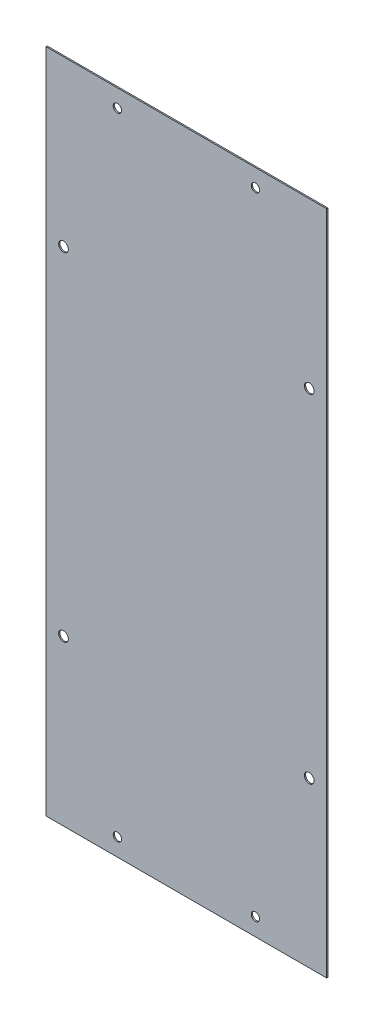
ISO-10303-21;
HEADER;
FILE_DESCRIPTION(('STEP AP214'),'2;1');
FILE_NAME('part.step','',(''),(''),'','','');
FILE_SCHEMA(('AUTOMOTIVE_DESIGN { 1 0 10303 214 1 1 1 1 }'));
ENDSEC;
DATA;
#1=APPLICATION_CONTEXT('core data for automotive mechanical design processes');
#2=APPLICATION_PROTOCOL_DEFINITION('international standard','automotive_design',2000,#1);
#3=PRODUCT_CONTEXT('',#1,'mechanical');
#4=PRODUCT('Part','Part','',(#3));
#5=PRODUCT_RELATED_PRODUCT_CATEGORY('part','',(#4));
#6=PRODUCT_DEFINITION_FORMATION('','',#4);
#7=PRODUCT_DEFINITION_CONTEXT('part definition',#1,'design');
#8=PRODUCT_DEFINITION('design','',#6,#7);
#9=PRODUCT_DEFINITION_SHAPE('','',#8);
#10=(LENGTH_UNIT() NAMED_UNIT(*) SI_UNIT(.MILLI.,.METRE.));
#11=(NAMED_UNIT(*) PLANE_ANGLE_UNIT() SI_UNIT($,.RADIAN.));
#12=(NAMED_UNIT(*) SI_UNIT($,.STERADIAN.) SOLID_ANGLE_UNIT());
#13=UNCERTAINTY_MEASURE_WITH_UNIT(LENGTH_MEASURE(1.E-05),#10,'distance_accuracy_value','');
#14=(GEOMETRIC_REPRESENTATION_CONTEXT(3) GLOBAL_UNCERTAINTY_ASSIGNED_CONTEXT((#13)) GLOBAL_UNIT_ASSIGNED_CONTEXT((#10,
#11,#12)) REPRESENTATION_CONTEXT('',''));
#15=CARTESIAN_POINT('',(0.,0.,0.));
#16=DIRECTION('',(0.,0.,1.));
#17=DIRECTION('',(1.,0.,0.));
#18=AXIS2_PLACEMENT_3D('',#15,#16,#17);
#19=CARTESIAN_POINT('',(101.6,241.3,0.9));
#20=DIRECTION('',(-1.,0.,0.));
#21=DIRECTION('',(0.,-1.,0.));
#22=AXIS2_PLACEMENT_3D('',#19,#20,#21);
#23=PLANE('',#22);
#24=DIRECTION('',(0.,1.,0.));
#25=VECTOR('',#24,1.);
#26=CARTESIAN_POINT('',(101.6,241.3,0.));
#27=LINE('',#26,#25);
#28=CARTESIAN_POINT('',(101.6,-241.3,0.));
#29=VERTEX_POINT('',#28);
#30=CARTESIAN_POINT('',(101.6,241.3,0.));
#31=VERTEX_POINT('',#30);
#32=EDGE_CURVE('E114',#29,#31,#27,.T.);
#33=ORIENTED_EDGE('',*,*,#32,.T.);
#34=DIRECTION('',(0.,0.,-1.));
#35=VECTOR('',#34,1.);
#36=CARTESIAN_POINT('',(101.6,241.3,0.9));
#37=LINE('',#36,#35);
#38=CARTESIAN_POINT('',(101.6,241.3,0.9));
#39=VERTEX_POINT('',#38);
#40=EDGE_CURVE('E11',#39,#31,#37,.T.);
#41=ORIENTED_EDGE('',*,*,#40,.F.);
#42=DIRECTION('',(0.,1.,0.));
#43=VECTOR('',#42,1.);
#44=CARTESIAN_POINT('',(101.6,241.3,0.9));
#45=LINE('',#44,#43);
#46=CARTESIAN_POINT('',(101.6,-241.3,0.9));
#47=VERTEX_POINT('',#46);
#48=EDGE_CURVE('E96',#47,#39,#45,.T.);
#49=ORIENTED_EDGE('',*,*,#48,.F.);
#50=DIRECTION('',(0.,0.,-1.));
#51=VECTOR('',#50,1.);
#52=CARTESIAN_POINT('',(101.6,-241.3,0.9));
#53=LINE('',#52,#51);
#54=EDGE_CURVE('E110',#47,#29,#53,.T.);
#55=ORIENTED_EDGE('',*,*,#54,.T.);
#56=EDGE_LOOP('',(#33,#41,#49,#55));
#57=FACE_BOUND('',#56,.T.);
#58=ADVANCED_FACE('F42',(#57),#23,.F.);
#59=CARTESIAN_POINT('',(-101.6,241.3,0.9));
#60=DIRECTION('',(0.,-1.,0.));
#61=DIRECTION('',(0.,0.,-1.));
#62=AXIS2_PLACEMENT_3D('',#59,#60,#61);
#63=PLANE('',#62);
#64=DIRECTION('',(-1.,0.,0.));
#65=VECTOR('',#64,1.);
#66=CARTESIAN_POINT('',(-101.6,241.3,0.));
#67=LINE('',#66,#65);
#68=CARTESIAN_POINT('',(-101.6,241.3,0.));
#69=VERTEX_POINT('',#68);
#70=EDGE_CURVE('E101',#31,#69,#67,.T.);
#71=ORIENTED_EDGE('',*,*,#70,.T.);
#72=DIRECTION('',(0.,0.,-1.));
#73=VECTOR('',#72,1.);
#74=CARTESIAN_POINT('',(-101.6,241.3,0.9));
#75=LINE('',#74,#73);
#76=CARTESIAN_POINT('',(-101.6,241.3,0.9));
#77=VERTEX_POINT('',#76);
#78=EDGE_CURVE('E52',#77,#69,#75,.T.);
#79=ORIENTED_EDGE('',*,*,#78,.F.);
#80=DIRECTION('',(-1.,0.,0.));
#81=VECTOR('',#80,1.);
#82=CARTESIAN_POINT('',(-101.6,241.3,0.9));
#83=LINE('',#82,#81);
#84=EDGE_CURVE('E91',#39,#77,#83,.T.);
#85=ORIENTED_EDGE('',*,*,#84,.F.);
#86=ORIENTED_EDGE('',*,*,#40,.T.);
#87=EDGE_LOOP('',(#71,#79,#85,#86));
#88=FACE_BOUND('',#87,.T.);
#89=ADVANCED_FACE('F100',(#88),#63,.F.);
#90=CARTESIAN_POINT('',(-101.6,241.3,0.9));
#91=DIRECTION('',(1.,0.,0.));
#92=DIRECTION('',(0.,1.,0.));
#93=AXIS2_PLACEMENT_3D('',#90,#91,#92);
#94=PLANE('',#93);
#95=DIRECTION('',(0.,-1.,0.));
#96=VECTOR('',#95,1.);
#97=CARTESIAN_POINT('',(-101.6,241.3,0.));
#98=LINE('',#97,#96);
#99=CARTESIAN_POINT('',(-101.6,-241.3,0.));
#100=VERTEX_POINT('',#99);
#101=EDGE_CURVE('E78',#69,#100,#98,.T.);
#102=ORIENTED_EDGE('',*,*,#101,.T.);
#103=DIRECTION('',(0.,0.,-1.));
#104=VECTOR('',#103,1.);
#105=CARTESIAN_POINT('',(-101.6,-241.3,0.9));
#106=LINE('',#105,#104);
#107=CARTESIAN_POINT('',(-101.6,-241.3,0.9));
#108=VERTEX_POINT('',#107);
#109=EDGE_CURVE('E103',#108,#100,#106,.T.);
#110=ORIENTED_EDGE('',*,*,#109,.F.);
#111=DIRECTION('',(0.,-1.,0.));
#112=VECTOR('',#111,1.);
#113=CARTESIAN_POINT('',(-101.6,241.3,0.9));
#114=LINE('',#113,#112);
#115=EDGE_CURVE('E94',#77,#108,#114,.T.);
#116=ORIENTED_EDGE('',*,*,#115,.F.);
#117=ORIENTED_EDGE('',*,*,#78,.T.);
#118=EDGE_LOOP('',(#102,#110,#116,#117));
#119=FACE_BOUND('',#118,.T.);
#120=ADVANCED_FACE('F105',(#119),#94,.F.);
#121=CARTESIAN_POINT('',(-101.6,-241.3,0.9));
#122=DIRECTION('',(0.,1.,0.));
#123=DIRECTION('',(0.,0.,1.));
#124=AXIS2_PLACEMENT_3D('',#121,#122,#123);
#125=PLANE('',#124);
#126=DIRECTION('',(1.,0.,0.));
#127=VECTOR('',#126,1.);
#128=CARTESIAN_POINT('',(-101.6,-241.3,0.));
#129=LINE('',#128,#127);
#130=EDGE_CURVE('E84',#100,#29,#129,.T.);
#131=ORIENTED_EDGE('',*,*,#130,.T.);
#132=ORIENTED_EDGE('',*,*,#54,.F.);
#133=DIRECTION('',(1.,0.,0.));
#134=VECTOR('',#133,1.);
#135=CARTESIAN_POINT('',(-101.6,-241.3,0.9));
#136=LINE('',#135,#134);
#137=EDGE_CURVE('E61',#108,#47,#136,.T.);
#138=ORIENTED_EDGE('',*,*,#137,.F.);
#139=ORIENTED_EDGE('',*,*,#109,.T.);
#140=EDGE_LOOP('',(#131,#132,#138,#139));
#141=FACE_BOUND('',#140,.T.);
#142=ADVANCED_FACE('F195',(#141),#125,.F.);
#143=CARTESIAN_POINT('',(0.,0.,0.9));
#144=DIRECTION('',(0.,0.,1.));
#145=DIRECTION('',(1.,0.,0.));
#146=AXIS2_PLACEMENT_3D('',#143,#144,#145);
#147=PLANE('',#146);
#148=CARTESIAN_POINT('',(89.,122.2,0.9));
#149=DIRECTION('',(0.,0.,1.));
#150=DIRECTION('',(1.,0.,0.));
#151=AXIS2_PLACEMENT_3D('',#148,#149,#150);
#152=CIRCLE('',#151,3.49999999999999);
#153=CARTESIAN_POINT('',(92.5,122.2,0.9));
#154=VERTEX_POINT('',#153);
#155=EDGE_CURVE('E355',#154,#154,#152,.T.);
#156=ORIENTED_EDGE('',*,*,#155,.F.);
#157=EDGE_LOOP('',(#156));
#158=FACE_BOUND('',#157,.T.);
#159=CARTESIAN_POINT('',(89.,-122.2,0.9));
#160=DIRECTION('',(0.,0.,1.));
#161=DIRECTION('',(-1.,0.,0.));
#162=AXIS2_PLACEMENT_3D('',#159,#160,#161);
#163=CIRCLE('',#162,3.49999999999999);
#164=CARTESIAN_POINT('',(85.5,-122.2,0.9));
#165=VERTEX_POINT('',#164);
#166=EDGE_CURVE('E348',#165,#165,#163,.T.);
#167=ORIENTED_EDGE('',*,*,#166,.F.);
#168=EDGE_LOOP('',(#167));
#169=FACE_BOUND('',#168,.T.);
#170=CARTESIAN_POINT('',(-89.,-122.2,0.9));
#171=DIRECTION('',(0.,0.,1.));
#172=DIRECTION('',(-1.,0.,0.));
#173=AXIS2_PLACEMENT_3D('',#170,#171,#172);
#174=CIRCLE('',#173,3.49999999999999);
#175=CARTESIAN_POINT('',(-92.5,-122.2,0.9));
#176=VERTEX_POINT('',#175);
#177=EDGE_CURVE('E328',#176,#176,#174,.T.);
#178=ORIENTED_EDGE('',*,*,#177,.F.);
#179=EDGE_LOOP('',(#178));
#180=FACE_BOUND('',#179,.T.);
#181=CARTESIAN_POINT('',(50.,228.6,0.9));
#182=DIRECTION('',(0.,0.,1.));
#183=DIRECTION('',(1.,0.,0.));
#184=AXIS2_PLACEMENT_3D('',#181,#182,#183);
#185=CIRCLE('',#184,3.00000000000001);
#186=CARTESIAN_POINT('',(53.,228.6,0.9));
#187=VERTEX_POINT('',#186);
#188=EDGE_CURVE('E349',#187,#187,#185,.T.);
#189=ORIENTED_EDGE('',*,*,#188,.F.);
#190=EDGE_LOOP('',(#189));
#191=FACE_BOUND('',#190,.T.);
#192=CARTESIAN_POINT('',(-50.,-228.6,0.9));
#193=DIRECTION('',(0.,0.,1.));
#194=DIRECTION('',(1.,0.,0.));
#195=AXIS2_PLACEMENT_3D('',#192,#193,#194);
#196=CIRCLE('',#195,3.00000000000001);
#197=CARTESIAN_POINT('',(-47.,-228.6,0.9));
#198=VERTEX_POINT('',#197);
#199=EDGE_CURVE('E381',#198,#198,#196,.T.);
#200=ORIENTED_EDGE('',*,*,#199,.F.);
#201=EDGE_LOOP('',(#200));
#202=FACE_BOUND('',#201,.T.);
#203=CARTESIAN_POINT('',(-50.,228.6,0.9));
#204=DIRECTION('',(0.,0.,1.));
#205=DIRECTION('',(-1.,0.,0.));
#206=AXIS2_PLACEMENT_3D('',#203,#204,#205);
#207=CIRCLE('',#206,3.00000000000001);
#208=CARTESIAN_POINT('',(-53.,228.6,0.9));
#209=VERTEX_POINT('',#208);
#210=EDGE_CURVE('E377',#209,#209,#207,.T.);
#211=ORIENTED_EDGE('',*,*,#210,.F.);
#212=EDGE_LOOP('',(#211));
#213=FACE_BOUND('',#212,.T.);
#214=CARTESIAN_POINT('',(50.,-228.6,0.9));
#215=DIRECTION('',(0.,0.,1.));
#216=DIRECTION('',(-1.,0.,0.));
#217=AXIS2_PLACEMENT_3D('',#214,#215,#216);
#218=CIRCLE('',#217,3.00000000000001);
#219=CARTESIAN_POINT('',(47.,-228.6,0.9));
#220=VERTEX_POINT('',#219);
#221=EDGE_CURVE('E358',#220,#220,#218,.T.);
#222=ORIENTED_EDGE('',*,*,#221,.F.);
#223=EDGE_LOOP('',(#222));
#224=FACE_BOUND('',#223,.T.);
#225=CARTESIAN_POINT('',(-89.,122.2,0.9));
#226=DIRECTION('',(0.,0.,1.));
#227=DIRECTION('',(1.,0.,0.));
#228=AXIS2_PLACEMENT_3D('',#225,#226,#227);
#229=CIRCLE('',#228,3.50000000000002);
#230=CARTESIAN_POINT('',(-85.5,122.2,0.9));
#231=VERTEX_POINT('',#230);
#232=EDGE_CURVE('E133',#231,#231,#229,.T.);
#233=ORIENTED_EDGE('',*,*,#232,.F.);
#234=EDGE_LOOP('',(#233));
#235=FACE_BOUND('',#234,.T.);
#236=ORIENTED_EDGE('',*,*,#48,.T.);
#237=ORIENTED_EDGE('',*,*,#84,.T.);
#238=ORIENTED_EDGE('',*,*,#115,.T.);
#239=ORIENTED_EDGE('',*,*,#137,.T.);
#240=EDGE_LOOP('',(#236,#237,#238,#239));
#241=FACE_BOUND('',#240,.T.);
#242=ADVANCED_FACE('F92',(#158,#169,#180,#191,#202,#213,#224,#235,#241),#147,.T.);
#243=CARTESIAN_POINT('',(0.,0.,0.));
#244=DIRECTION('',(0.,0.,1.));
#245=DIRECTION('',(1.,0.,0.));
#246=AXIS2_PLACEMENT_3D('',#243,#244,#245);
#247=PLANE('',#246);
#248=CARTESIAN_POINT('',(89.,122.2,0.));
#249=DIRECTION('',(0.,0.,1.));
#250=DIRECTION('',(1.,0.,0.));
#251=AXIS2_PLACEMENT_3D('',#248,#249,#250);
#252=CIRCLE('',#251,3.49999999999999);
#253=CARTESIAN_POINT('',(92.5,122.2,0.));
#254=VERTEX_POINT('',#253);
#255=EDGE_CURVE('E45',#254,#254,#252,.T.);
#256=ORIENTED_EDGE('',*,*,#255,.T.);
#257=EDGE_LOOP('',(#256));
#258=FACE_BOUND('',#257,.T.);
#259=CARTESIAN_POINT('',(89.,-122.2,0.));
#260=DIRECTION('',(0.,0.,1.));
#261=DIRECTION('',(1.,0.,0.));
#262=AXIS2_PLACEMENT_3D('',#259,#260,#261);
#263=CIRCLE('',#262,3.49999999999999);
#264=CARTESIAN_POINT('',(92.5,-122.2,0.));
#265=VERTEX_POINT('',#264);
#266=EDGE_CURVE('E152',#265,#265,#263,.T.);
#267=ORIENTED_EDGE('',*,*,#266,.T.);
#268=EDGE_LOOP('',(#267));
#269=FACE_BOUND('',#268,.T.);
#270=CARTESIAN_POINT('',(-89.,-122.2,0.));
#271=DIRECTION('',(0.,0.,1.));
#272=DIRECTION('',(1.,0.,0.));
#273=AXIS2_PLACEMENT_3D('',#270,#271,#272);
#274=CIRCLE('',#273,3.49999999999999);
#275=CARTESIAN_POINT('',(-85.5,-122.2,0.));
#276=VERTEX_POINT('',#275);
#277=EDGE_CURVE('E149',#276,#276,#274,.T.);
#278=ORIENTED_EDGE('',*,*,#277,.T.);
#279=EDGE_LOOP('',(#278));
#280=FACE_BOUND('',#279,.T.);
#281=CARTESIAN_POINT('',(50.,228.6,0.));
#282=DIRECTION('',(0.,0.,1.));
#283=DIRECTION('',(1.,0.,0.));
#284=AXIS2_PLACEMENT_3D('',#281,#282,#283);
#285=CIRCLE('',#284,3.00000000000001);
#286=CARTESIAN_POINT('',(53.,228.6,0.));
#287=VERTEX_POINT('',#286);
#288=EDGE_CURVE('E145',#287,#287,#285,.T.);
#289=ORIENTED_EDGE('',*,*,#288,.T.);
#290=EDGE_LOOP('',(#289));
#291=FACE_BOUND('',#290,.T.);
#292=CARTESIAN_POINT('',(-50.,-228.6,0.));
#293=DIRECTION('',(0.,0.,1.));
#294=DIRECTION('',(1.,0.,0.));
#295=AXIS2_PLACEMENT_3D('',#292,#293,#294);
#296=CIRCLE('',#295,3.00000000000001);
#297=CARTESIAN_POINT('',(-47.,-228.6,0.));
#298=VERTEX_POINT('',#297);
#299=EDGE_CURVE('E141',#298,#298,#296,.T.);
#300=ORIENTED_EDGE('',*,*,#299,.T.);
#301=EDGE_LOOP('',(#300));
#302=FACE_BOUND('',#301,.T.);
#303=CARTESIAN_POINT('',(-50.,228.6,0.));
#304=DIRECTION('',(0.,0.,1.));
#305=DIRECTION('',(1.,0.,0.));
#306=AXIS2_PLACEMENT_3D('',#303,#304,#305);
#307=CIRCLE('',#306,3.00000000000001);
#308=CARTESIAN_POINT('',(-47.,228.6,0.));
#309=VERTEX_POINT('',#308);
#310=EDGE_CURVE('E137',#309,#309,#307,.T.);
#311=ORIENTED_EDGE('',*,*,#310,.T.);
#312=EDGE_LOOP('',(#311));
#313=FACE_BOUND('',#312,.T.);
#314=CARTESIAN_POINT('',(50.,-228.6,0.));
#315=DIRECTION('',(0.,0.,1.));
#316=DIRECTION('',(1.,0.,0.));
#317=AXIS2_PLACEMENT_3D('',#314,#315,#316);
#318=CIRCLE('',#317,3.00000000000001);
#319=CARTESIAN_POINT('',(53.,-228.6,0.));
#320=VERTEX_POINT('',#319);
#321=EDGE_CURVE('E132',#320,#320,#318,.T.);
#322=ORIENTED_EDGE('',*,*,#321,.T.);
#323=EDGE_LOOP('',(#322));
#324=FACE_BOUND('',#323,.T.);
#325=CARTESIAN_POINT('',(-89.,122.2,0.));
#326=DIRECTION('',(0.,0.,1.));
#327=DIRECTION('',(1.,0.,0.));
#328=AXIS2_PLACEMENT_3D('',#325,#326,#327);
#329=CIRCLE('',#328,3.50000000000002);
#330=CARTESIAN_POINT('',(-85.5,122.2,0.));
#331=VERTEX_POINT('',#330);
#332=EDGE_CURVE('E128',#331,#331,#329,.T.);
#333=ORIENTED_EDGE('',*,*,#332,.T.);
#334=EDGE_LOOP('',(#333));
#335=FACE_BOUND('',#334,.T.);
#336=ORIENTED_EDGE('',*,*,#32,.F.);
#337=ORIENTED_EDGE('',*,*,#130,.F.);
#338=ORIENTED_EDGE('',*,*,#101,.F.);
#339=ORIENTED_EDGE('',*,*,#70,.F.);
#340=EDGE_LOOP('',(#336,#337,#338,#339));
#341=FACE_BOUND('',#340,.T.);
#342=ADVANCED_FACE('F163',(#258,#269,#280,#291,#302,#313,#324,#335,#341),#247,.F.);
#343=CARTESIAN_POINT('',(-89.,122.2,-9.1));
#344=DIRECTION('',(0.,0.,1.));
#345=DIRECTION('',(1.,0.,0.));
#346=AXIS2_PLACEMENT_3D('',#343,#344,#345);
#347=CYLINDRICAL_SURFACE('',#346,3.50000000000002);
#348=ORIENTED_EDGE('',*,*,#232,.T.);
#349=EDGE_LOOP('',(#348));
#350=FACE_BOUND('',#349,.T.);
#351=ORIENTED_EDGE('',*,*,#332,.F.);
#352=EDGE_LOOP('',(#351));
#353=FACE_BOUND('',#352,.T.);
#354=ADVANCED_FACE('F186',(#350,#353),#347,.F.);
#355=CARTESIAN_POINT('',(50.,-228.6,-9.1));
#356=DIRECTION('',(0.,0.,1.));
#357=DIRECTION('',(1.,0.,0.));
#358=AXIS2_PLACEMENT_3D('',#355,#356,#357);
#359=CYLINDRICAL_SURFACE('',#358,3.00000000000001);
#360=ORIENTED_EDGE('',*,*,#221,.T.);
#361=EDGE_LOOP('',(#360));
#362=FACE_BOUND('',#361,.T.);
#363=ORIENTED_EDGE('',*,*,#321,.F.);
#364=EDGE_LOOP('',(#363));
#365=FACE_BOUND('',#364,.T.);
#366=ADVANCED_FACE('F192',(#362,#365),#359,.F.);
#367=CARTESIAN_POINT('',(-50.,228.6,-9.1));
#368=DIRECTION('',(0.,0.,1.));
#369=DIRECTION('',(1.,0.,0.));
#370=AXIS2_PLACEMENT_3D('',#367,#368,#369);
#371=CYLINDRICAL_SURFACE('',#370,3.00000000000001);
#372=ORIENTED_EDGE('',*,*,#210,.T.);
#373=EDGE_LOOP('',(#372));
#374=FACE_BOUND('',#373,.T.);
#375=ORIENTED_EDGE('',*,*,#310,.F.);
#376=EDGE_LOOP('',(#375));
#377=FACE_BOUND('',#376,.T.);
#378=ADVANCED_FACE('F233',(#374,#377),#371,.F.);
#379=CARTESIAN_POINT('',(-50.,-228.6,-9.1));
#380=DIRECTION('',(0.,0.,1.));
#381=DIRECTION('',(1.,0.,0.));
#382=AXIS2_PLACEMENT_3D('',#379,#380,#381);
#383=CYLINDRICAL_SURFACE('',#382,3.00000000000001);
#384=ORIENTED_EDGE('',*,*,#199,.T.);
#385=EDGE_LOOP('',(#384));
#386=FACE_BOUND('',#385,.T.);
#387=ORIENTED_EDGE('',*,*,#299,.F.);
#388=EDGE_LOOP('',(#387));
#389=FACE_BOUND('',#388,.T.);
#390=ADVANCED_FACE('F243',(#386,#389),#383,.F.);
#391=CARTESIAN_POINT('',(50.,228.6,-9.1));
#392=DIRECTION('',(0.,0.,1.));
#393=DIRECTION('',(1.,0.,0.));
#394=AXIS2_PLACEMENT_3D('',#391,#392,#393);
#395=CYLINDRICAL_SURFACE('',#394,3.00000000000001);
#396=ORIENTED_EDGE('',*,*,#188,.T.);
#397=EDGE_LOOP('',(#396));
#398=FACE_BOUND('',#397,.T.);
#399=ORIENTED_EDGE('',*,*,#288,.F.);
#400=EDGE_LOOP('',(#399));
#401=FACE_BOUND('',#400,.T.);
#402=ADVANCED_FACE('F252',(#398,#401),#395,.F.);
#403=CARTESIAN_POINT('',(-89.,-122.2,-9.1));
#404=DIRECTION('',(0.,0.,1.));
#405=DIRECTION('',(1.,0.,0.));
#406=AXIS2_PLACEMENT_3D('',#403,#404,#405);
#407=CYLINDRICAL_SURFACE('',#406,3.49999999999999);
#408=ORIENTED_EDGE('',*,*,#177,.T.);
#409=EDGE_LOOP('',(#408));
#410=FACE_BOUND('',#409,.T.);
#411=ORIENTED_EDGE('',*,*,#277,.F.);
#412=EDGE_LOOP('',(#411));
#413=FACE_BOUND('',#412,.T.);
#414=ADVANCED_FACE('F173',(#410,#413),#407,.F.);
#415=CARTESIAN_POINT('',(89.,-122.2,-9.1));
#416=DIRECTION('',(0.,0.,1.));
#417=DIRECTION('',(1.,0.,0.));
#418=AXIS2_PLACEMENT_3D('',#415,#416,#417);
#419=CYLINDRICAL_SURFACE('',#418,3.49999999999999);
#420=ORIENTED_EDGE('',*,*,#166,.T.);
#421=EDGE_LOOP('',(#420));
#422=FACE_BOUND('',#421,.T.);
#423=ORIENTED_EDGE('',*,*,#266,.F.);
#424=EDGE_LOOP('',(#423));
#425=FACE_BOUND('',#424,.T.);
#426=ADVANCED_FACE('F167',(#422,#425),#419,.F.);
#427=CARTESIAN_POINT('',(89.,122.2,-9.1));
#428=DIRECTION('',(0.,0.,1.));
#429=DIRECTION('',(1.,0.,0.));
#430=AXIS2_PLACEMENT_3D('',#427,#428,#429);
#431=CYLINDRICAL_SURFACE('',#430,3.49999999999999);
#432=ORIENTED_EDGE('',*,*,#155,.T.);
#433=EDGE_LOOP('',(#432));
#434=FACE_BOUND('',#433,.T.);
#435=ORIENTED_EDGE('',*,*,#255,.F.);
#436=EDGE_LOOP('',(#435));
#437=FACE_BOUND('',#436,.T.);
#438=ADVANCED_FACE('F165',(#434,#437),#431,.F.);
#439=CLOSED_SHELL('',(#58,#89,#120,#142,#242,#342,#354,#366,#378,#390,#402,#414,#426,#438));
#440=MANIFOLD_SOLID_BREP('B2',#439);
#441=ADVANCED_BREP_SHAPE_REPRESENTATION('',(#18,#440),#14);
#442=SHAPE_DEFINITION_REPRESENTATION(#9,#441);
ENDSEC;
END-ISO-10303-21;
